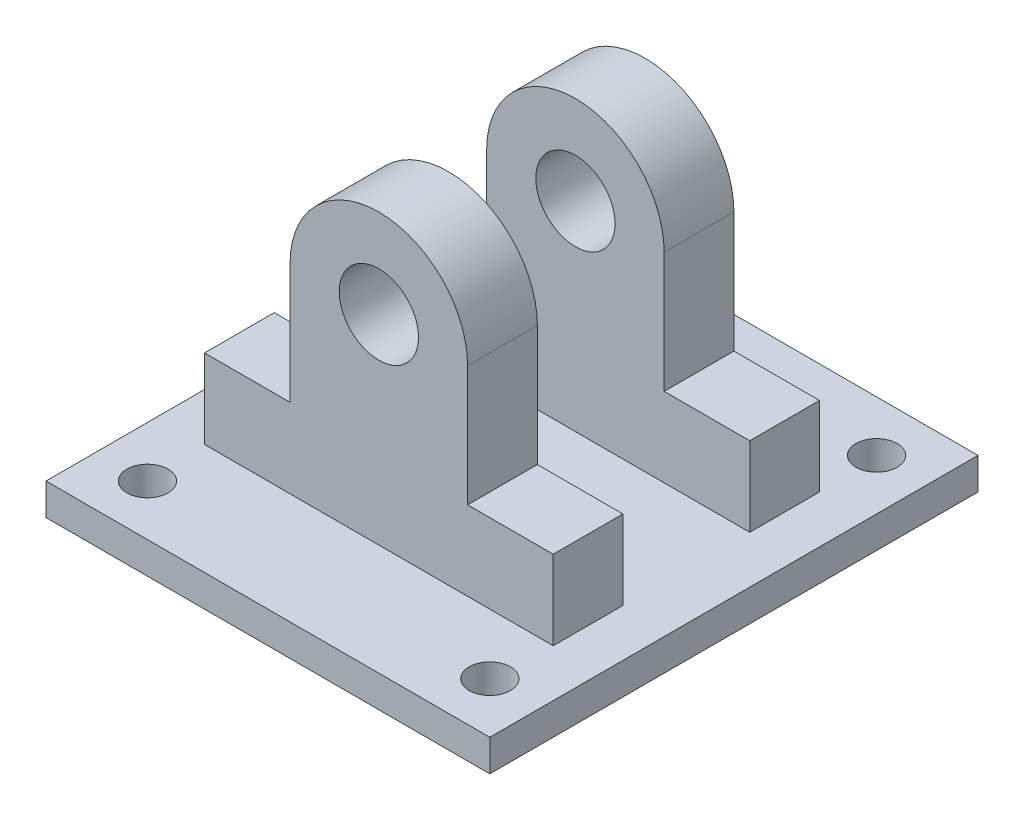
ISO-10303-21;
HEADER;
FILE_DESCRIPTION(('STEP AP214'),'2;1');
FILE_NAME('part.step','',(''),(''),'','','');
FILE_SCHEMA(('AUTOMOTIVE_DESIGN { 1 0 10303 214 1 1 1 1 }'));
ENDSEC;
DATA;
#1=APPLICATION_CONTEXT('core data for automotive mechanical design processes');
#2=APPLICATION_PROTOCOL_DEFINITION('international standard','automotive_design',2000,#1);
#3=PRODUCT_CONTEXT('',#1,'mechanical');
#4=PRODUCT('Part','Part','',(#3));
#5=PRODUCT_RELATED_PRODUCT_CATEGORY('part','',(#4));
#6=PRODUCT_DEFINITION_FORMATION('','',#4);
#7=PRODUCT_DEFINITION_CONTEXT('part definition',#1,'design');
#8=PRODUCT_DEFINITION('design','',#6,#7);
#9=PRODUCT_DEFINITION_SHAPE('','',#8);
#10=(LENGTH_UNIT() NAMED_UNIT(*) SI_UNIT(.MILLI.,.METRE.));
#11=(NAMED_UNIT(*) PLANE_ANGLE_UNIT() SI_UNIT($,.RADIAN.));
#12=(NAMED_UNIT(*) SI_UNIT($,.STERADIAN.) SOLID_ANGLE_UNIT());
#13=UNCERTAINTY_MEASURE_WITH_UNIT(LENGTH_MEASURE(1.E-05),#10,'distance_accuracy_value','');
#14=(GEOMETRIC_REPRESENTATION_CONTEXT(3) GLOBAL_UNCERTAINTY_ASSIGNED_CONTEXT((#13)) GLOBAL_UNIT_ASSIGNED_CONTEXT((#10,
#11,#12)) REPRESENTATION_CONTEXT('',''));
#15=CARTESIAN_POINT('',(0.,0.,0.));
#16=DIRECTION('',(0.,0.,1.));
#17=DIRECTION('',(1.,0.,0.));
#18=AXIS2_PLACEMENT_3D('',#15,#16,#17);
#19=CARTESIAN_POINT('',(-70.,160.,77.));
#20=DIRECTION('',(0.,-1.,0.));
#21=DIRECTION('',(1.,0.,0.));
#22=AXIS2_PLACEMENT_3D('',#19,#20,#21);
#23=PLANE('',#22);
#24=DIRECTION('',(0.,0.,-1.));
#25=VECTOR('',#24,1.);
#26=CARTESIAN_POINT('',(54.9999999999999,159.999999999999,42.));
#27=LINE('',#26,#25);
#28=CARTESIAN_POINT('',(55.,160.,42.));
#29=VERTEX_POINT('',#28);
#30=CARTESIAN_POINT('',(55.,160.,20.));
#31=VERTEX_POINT('',#30);
#32=EDGE_CURVE('E60',#29,#31,#27,.T.);
#33=ORIENTED_EDGE('',*,*,#32,.F.);
#34=DIRECTION('',(1.,0.,0.));
#35=VECTOR('',#34,1.);
#36=CARTESIAN_POINT('',(-55.0000000000001,160.,42.));
#37=LINE('',#36,#35);
#38=CARTESIAN_POINT('',(-55.0000000000001,160.,42.));
#39=VERTEX_POINT('',#38);
#40=EDGE_CURVE('E210',#39,#29,#37,.T.);
#41=ORIENTED_EDGE('',*,*,#40,.F.);
#42=DIRECTION('',(0.,0.,-1.));
#43=VECTOR('',#42,1.);
#44=CARTESIAN_POINT('',(-55.0000000000001,160.,42.));
#45=LINE('',#44,#43);
#46=CARTESIAN_POINT('',(-55.0000000000001,160.,20.));
#47=VERTEX_POINT('',#46);
#48=EDGE_CURVE('E229',#39,#47,#45,.T.);
#49=ORIENTED_EDGE('',*,*,#48,.T.);
#50=DIRECTION('',(1.,0.,0.));
#51=VECTOR('',#50,1.);
#52=CARTESIAN_POINT('',(-55.0000000000001,160.,20.));
#53=LINE('',#52,#51);
#54=EDGE_CURVE('E208',#47,#31,#53,.T.);
#55=ORIENTED_EDGE('',*,*,#54,.T.);
#56=EDGE_LOOP('',(#33,#41,#49,#55));
#57=FACE_BOUND('',#56,.T.);
#58=CARTESIAN_POINT('',(-54.,160.,-61.));
#59=DIRECTION('',(0.,1.,0.));
#60=DIRECTION('',(0.,0.,1.));
#61=AXIS2_PLACEMENT_3D('',#58,#59,#60);
#62=CIRCLE('',#61,6.50000000000001);
#63=CARTESIAN_POINT('',(-54.,160.,-54.5));
#64=VERTEX_POINT('',#63);
#65=EDGE_CURVE('E270',#64,#64,#62,.T.);
#66=ORIENTED_EDGE('',*,*,#65,.F.);
#67=EDGE_LOOP('',(#66));
#68=FACE_BOUND('',#67,.T.);
#69=CARTESIAN_POINT('',(54.,160.,61.));
#70=DIRECTION('',(0.,1.,0.));
#71=DIRECTION('',(0.,0.,-1.));
#72=AXIS2_PLACEMENT_3D('',#69,#70,#71);
#73=CIRCLE('',#72,6.50000000000001);
#74=CARTESIAN_POINT('',(54.,160.,54.5));
#75=VERTEX_POINT('',#74);
#76=EDGE_CURVE('E265',#75,#75,#73,.T.);
#77=ORIENTED_EDGE('',*,*,#76,.F.);
#78=EDGE_LOOP('',(#77));
#79=FACE_BOUND('',#78,.T.);
#80=DIRECTION('',(-1.,0.,0.));
#81=VECTOR('',#80,1.);
#82=CARTESIAN_POINT('',(-70.,160.,-77.));
#83=LINE('',#82,#81);
#84=CARTESIAN_POINT('',(70.,160.,-77.));
#85=VERTEX_POINT('',#84);
#86=CARTESIAN_POINT('',(-70.,160.,-77.));
#87=VERTEX_POINT('',#86);
#88=EDGE_CURVE('E294',#85,#87,#83,.T.);
#89=ORIENTED_EDGE('',*,*,#88,.T.);
#90=DIRECTION('',(0.,0.,-1.));
#91=VECTOR('',#90,1.);
#92=CARTESIAN_POINT('',(-70.,160.,77.));
#93=LINE('',#92,#91);
#94=CARTESIAN_POINT('',(-70.,160.,77.));
#95=VERTEX_POINT('',#94);
#96=EDGE_CURVE('E300',#95,#87,#93,.T.);
#97=ORIENTED_EDGE('',*,*,#96,.F.);
#98=DIRECTION('',(-1.,0.,0.));
#99=VECTOR('',#98,1.);
#100=CARTESIAN_POINT('',(-70.,160.,77.));
#101=LINE('',#100,#99);
#102=CARTESIAN_POINT('',(70.,160.,77.));
#103=VERTEX_POINT('',#102);
#104=EDGE_CURVE('E298',#103,#95,#101,.T.);
#105=ORIENTED_EDGE('',*,*,#104,.F.);
#106=DIRECTION('',(0.,0.,-1.));
#107=VECTOR('',#106,1.);
#108=CARTESIAN_POINT('',(70.,160.,77.));
#109=LINE('',#108,#107);
#110=EDGE_CURVE('E310',#103,#85,#109,.T.);
#111=ORIENTED_EDGE('',*,*,#110,.T.);
#112=EDGE_LOOP('',(#89,#97,#105,#111));
#113=FACE_BOUND('',#112,.T.);
#114=CARTESIAN_POINT('',(-54.,160.,61.));
#115=DIRECTION('',(0.,1.,0.));
#116=DIRECTION('',(0.,0.,-1.));
#117=AXIS2_PLACEMENT_3D('',#114,#115,#116);
#118=CIRCLE('',#117,6.50000000000001);
#119=CARTESIAN_POINT('',(-54.,160.,54.5));
#120=VERTEX_POINT('',#119);
#121=EDGE_CURVE('E273',#120,#120,#118,.T.);
#122=ORIENTED_EDGE('',*,*,#121,.F.);
#123=EDGE_LOOP('',(#122));
#124=FACE_BOUND('',#123,.T.);
#125=CARTESIAN_POINT('',(54.,160.,-61.));
#126=DIRECTION('',(0.,1.,0.));
#127=DIRECTION('',(0.,0.,1.));
#128=AXIS2_PLACEMENT_3D('',#125,#126,#127);
#129=CIRCLE('',#128,6.50000000000001);
#130=CARTESIAN_POINT('',(54.,160.,-54.5));
#131=VERTEX_POINT('',#130);
#132=EDGE_CURVE('E266',#131,#131,#129,.T.);
#133=ORIENTED_EDGE('',*,*,#132,.F.);
#134=EDGE_LOOP('',(#133));
#135=FACE_BOUND('',#134,.T.);
#136=DIRECTION('',(1.,0.,0.));
#137=VECTOR('',#136,1.);
#138=CARTESIAN_POINT('',(-55.0000000000001,160.,-42.));
#139=LINE('',#138,#137);
#140=CARTESIAN_POINT('',(-55.0000000000001,160.,-42.));
#141=VERTEX_POINT('',#140);
#142=CARTESIAN_POINT('',(54.9999999999999,159.999999999999,-42.));
#143=VERTEX_POINT('',#142);
#144=EDGE_CURVE('E176',#141,#143,#139,.T.);
#145=ORIENTED_EDGE('',*,*,#144,.T.);
#146=DIRECTION('',(0.,0.,1.));
#147=VECTOR('',#146,1.);
#148=CARTESIAN_POINT('',(54.9999999999999,159.999999999999,-42.));
#149=LINE('',#148,#147);
#150=CARTESIAN_POINT('',(54.9999999999999,159.999999999999,-20.));
#151=VERTEX_POINT('',#150);
#152=EDGE_CURVE('E666',#143,#151,#149,.T.);
#153=ORIENTED_EDGE('',*,*,#152,.T.);
#154=DIRECTION('',(1.,0.,0.));
#155=VECTOR('',#154,1.);
#156=CARTESIAN_POINT('',(-55.0000000000001,160.,-20.));
#157=LINE('',#156,#155);
#158=CARTESIAN_POINT('',(-55.0000000000001,160.,-20.));
#159=VERTEX_POINT('',#158);
#160=EDGE_CURVE('E197',#159,#151,#157,.T.);
#161=ORIENTED_EDGE('',*,*,#160,.F.);
#162=DIRECTION('',(0.,0.,1.));
#163=VECTOR('',#162,1.);
#164=CARTESIAN_POINT('',(-55.0000000000001,160.,-42.));
#165=LINE('',#164,#163);
#166=EDGE_CURVE('E192',#141,#159,#165,.T.);
#167=ORIENTED_EDGE('',*,*,#166,.F.);
#168=EDGE_LOOP('',(#145,#153,#161,#167));
#169=FACE_BOUND('',#168,.T.);
#170=ADVANCED_FACE('F37',(#57,#68,#79,#113,#124,#135,#169),#23,.F.);
#171=CARTESIAN_POINT('',(-70.,150.,77.));
#172=DIRECTION('',(0.,1.,0.));
#173=DIRECTION('',(-1.,0.,0.));
#174=AXIS2_PLACEMENT_3D('',#171,#172,#173);
#175=PLANE('',#174);
#176=CARTESIAN_POINT('',(-54.,150.,-61.));
#177=DIRECTION('',(0.,1.,0.));
#178=DIRECTION('',(-1.,0.,0.));
#179=AXIS2_PLACEMENT_3D('',#176,#177,#178);
#180=CIRCLE('',#179,6.50000000000001);
#181=CARTESIAN_POINT('',(-60.5,150.,-61.));
#182=VERTEX_POINT('',#181);
#183=EDGE_CURVE('E283',#182,#182,#180,.F.);
#184=ORIENTED_EDGE('',*,*,#183,.F.);
#185=EDGE_LOOP('',(#184));
#186=FACE_BOUND('',#185,.T.);
#187=CARTESIAN_POINT('',(54.,150.,61.));
#188=DIRECTION('',(0.,1.,0.));
#189=DIRECTION('',(-1.,0.,0.));
#190=AXIS2_PLACEMENT_3D('',#187,#188,#189);
#191=CIRCLE('',#190,6.50000000000001);
#192=CARTESIAN_POINT('',(47.5,150.,61.));
#193=VERTEX_POINT('',#192);
#194=EDGE_CURVE('E269',#193,#193,#191,.F.);
#195=ORIENTED_EDGE('',*,*,#194,.F.);
#196=EDGE_LOOP('',(#195));
#197=FACE_BOUND('',#196,.T.);
#198=DIRECTION('',(1.,0.,0.));
#199=VECTOR('',#198,1.);
#200=CARTESIAN_POINT('',(-70.,150.,-77.));
#201=LINE('',#200,#199);
#202=CARTESIAN_POINT('',(-70.,150.,-77.));
#203=VERTEX_POINT('',#202);
#204=CARTESIAN_POINT('',(70.,150.,-77.));
#205=VERTEX_POINT('',#204);
#206=EDGE_CURVE('E303',#203,#205,#201,.T.);
#207=ORIENTED_EDGE('',*,*,#206,.T.);
#208=DIRECTION('',(0.,0.,-1.));
#209=VECTOR('',#208,1.);
#210=CARTESIAN_POINT('',(70.,150.,77.));
#211=LINE('',#210,#209);
#212=CARTESIAN_POINT('',(70.,150.,77.));
#213=VERTEX_POINT('',#212);
#214=EDGE_CURVE('E45',#213,#205,#211,.T.);
#215=ORIENTED_EDGE('',*,*,#214,.F.);
#216=DIRECTION('',(1.,0.,0.));
#217=VECTOR('',#216,1.);
#218=CARTESIAN_POINT('',(-70.,150.,77.));
#219=LINE('',#218,#217);
#220=CARTESIAN_POINT('',(-70.,150.,77.));
#221=VERTEX_POINT('',#220);
#222=EDGE_CURVE('E293',#221,#213,#219,.T.);
#223=ORIENTED_EDGE('',*,*,#222,.F.);
#224=DIRECTION('',(0.,0.,-1.));
#225=VECTOR('',#224,1.);
#226=CARTESIAN_POINT('',(-70.,150.,77.));
#227=LINE('',#226,#225);
#228=EDGE_CURVE('E11',#221,#203,#227,.T.);
#229=ORIENTED_EDGE('',*,*,#228,.T.);
#230=EDGE_LOOP('',(#207,#215,#223,#229));
#231=FACE_BOUND('',#230,.T.);
#232=CARTESIAN_POINT('',(-54.,150.,61.));
#233=DIRECTION('',(0.,1.,0.));
#234=DIRECTION('',(-1.,0.,0.));
#235=AXIS2_PLACEMENT_3D('',#232,#233,#234);
#236=CIRCLE('',#235,6.50000000000001);
#237=CARTESIAN_POINT('',(-60.5,150.,61.));
#238=VERTEX_POINT('',#237);
#239=EDGE_CURVE('E280',#238,#238,#236,.F.);
#240=ORIENTED_EDGE('',*,*,#239,.F.);
#241=EDGE_LOOP('',(#240));
#242=FACE_BOUND('',#241,.T.);
#243=CARTESIAN_POINT('',(54.,150.,-61.));
#244=DIRECTION('',(0.,1.,0.));
#245=DIRECTION('',(-1.,0.,0.));
#246=AXIS2_PLACEMENT_3D('',#243,#244,#245);
#247=CIRCLE('',#246,6.50000000000001);
#248=CARTESIAN_POINT('',(47.5,150.,-61.));
#249=VERTEX_POINT('',#248);
#250=EDGE_CURVE('E286',#249,#249,#247,.F.);
#251=ORIENTED_EDGE('',*,*,#250,.F.);
#252=EDGE_LOOP('',(#251));
#253=FACE_BOUND('',#252,.T.);
#254=ADVANCED_FACE('F333',(#186,#197,#231,#242,#253),#175,.F.);
#255=CARTESIAN_POINT('',(-70.,150.,77.));
#256=DIRECTION('',(1.,0.,0.));
#257=DIRECTION('',(0.,1.,0.));
#258=AXIS2_PLACEMENT_3D('',#255,#256,#257);
#259=PLANE('',#258);
#260=DIRECTION('',(0.,-1.,0.));
#261=VECTOR('',#260,1.);
#262=CARTESIAN_POINT('',(-70.,150.,-77.));
#263=LINE('',#262,#261);
#264=EDGE_CURVE('E289',#87,#203,#263,.T.);
#265=ORIENTED_EDGE('',*,*,#264,.T.);
#266=ORIENTED_EDGE('',*,*,#228,.F.);
#267=DIRECTION('',(0.,-1.,0.));
#268=VECTOR('',#267,1.);
#269=CARTESIAN_POINT('',(-70.,150.,77.));
#270=LINE('',#269,#268);
#271=EDGE_CURVE('E290',#95,#221,#270,.T.);
#272=ORIENTED_EDGE('',*,*,#271,.F.);
#273=ORIENTED_EDGE('',*,*,#96,.T.);
#274=EDGE_LOOP('',(#265,#266,#272,#273));
#275=FACE_BOUND('',#274,.T.);
#276=ADVANCED_FACE('F39',(#275),#259,.F.);
#277=CARTESIAN_POINT('',(70.,150.,77.));
#278=DIRECTION('',(-1.,0.,0.));
#279=DIRECTION('',(0.,0.,1.));
#280=AXIS2_PLACEMENT_3D('',#277,#278,#279);
#281=PLANE('',#280);
#282=DIRECTION('',(0.,1.,0.));
#283=VECTOR('',#282,1.);
#284=CARTESIAN_POINT('',(70.,150.,-77.));
#285=LINE('',#284,#283);
#286=EDGE_CURVE('E305',#205,#85,#285,.T.);
#287=ORIENTED_EDGE('',*,*,#286,.T.);
#288=ORIENTED_EDGE('',*,*,#110,.F.);
#289=DIRECTION('',(0.,1.,0.));
#290=VECTOR('',#289,1.);
#291=CARTESIAN_POINT('',(70.,150.,77.));
#292=LINE('',#291,#290);
#293=EDGE_CURVE('E296',#213,#103,#292,.T.);
#294=ORIENTED_EDGE('',*,*,#293,.F.);
#295=ORIENTED_EDGE('',*,*,#214,.T.);
#296=EDGE_LOOP('',(#287,#288,#294,#295));
#297=FACE_BOUND('',#296,.T.);
#298=ADVANCED_FACE('F317',(#297),#281,.F.);
#299=CARTESIAN_POINT('',(0.,0.,77.));
#300=DIRECTION('',(0.,0.,-1.));
#301=DIRECTION('',(-1.,0.,0.));
#302=AXIS2_PLACEMENT_3D('',#299,#300,#301);
#303=PLANE('',#302);
#304=ORIENTED_EDGE('',*,*,#271,.T.);
#305=ORIENTED_EDGE('',*,*,#222,.T.);
#306=ORIENTED_EDGE('',*,*,#293,.T.);
#307=ORIENTED_EDGE('',*,*,#104,.T.);
#308=EDGE_LOOP('',(#304,#305,#306,#307));
#309=FACE_BOUND('',#308,.T.);
#310=ADVANCED_FACE('F332',(#309),#303,.F.);
#311=CARTESIAN_POINT('',(0.,0.,-77.));
#312=DIRECTION('',(0.,0.,-1.));
#313=DIRECTION('',(-1.,0.,0.));
#314=AXIS2_PLACEMENT_3D('',#311,#312,#313);
#315=PLANE('',#314);
#316=ORIENTED_EDGE('',*,*,#264,.F.);
#317=ORIENTED_EDGE('',*,*,#88,.F.);
#318=ORIENTED_EDGE('',*,*,#286,.F.);
#319=ORIENTED_EDGE('',*,*,#206,.F.);
#320=EDGE_LOOP('',(#316,#317,#318,#319));
#321=FACE_BOUND('',#320,.T.);
#322=ADVANCED_FACE('F323',(#321),#315,.T.);
#323=CARTESIAN_POINT('',(54.,160.,61.));
#324=DIRECTION('',(0.,-1.,0.));
#325=DIRECTION('',(0.,0.,-1.));
#326=AXIS2_PLACEMENT_3D('',#323,#324,#325);
#327=CYLINDRICAL_SURFACE('',#326,6.50000000000001);
#328=ORIENTED_EDGE('',*,*,#76,.T.);
#329=EDGE_LOOP('',(#328));
#330=FACE_BOUND('',#329,.T.);
#331=ORIENTED_EDGE('',*,*,#194,.T.);
#332=EDGE_LOOP('',(#331));
#333=FACE_BOUND('',#332,.T.);
#334=ADVANCED_FACE('F388',(#330,#333),#327,.F.);
#335=CARTESIAN_POINT('',(-54.,160.,61.));
#336=DIRECTION('',(0.,-1.,0.));
#337=DIRECTION('',(0.,0.,-1.));
#338=AXIS2_PLACEMENT_3D('',#335,#336,#337);
#339=CYLINDRICAL_SURFACE('',#338,6.50000000000001);
#340=ORIENTED_EDGE('',*,*,#121,.T.);
#341=EDGE_LOOP('',(#340));
#342=FACE_BOUND('',#341,.T.);
#343=ORIENTED_EDGE('',*,*,#239,.T.);
#344=EDGE_LOOP('',(#343));
#345=FACE_BOUND('',#344,.T.);
#346=ADVANCED_FACE('F354',(#342,#345),#339,.F.);
#347=CARTESIAN_POINT('',(-54.,160.,-61.));
#348=DIRECTION('',(0.,-1.,0.));
#349=DIRECTION('',(0.,0.,-1.));
#350=AXIS2_PLACEMENT_3D('',#347,#348,#349);
#351=CYLINDRICAL_SURFACE('',#350,6.50000000000001);
#352=ORIENTED_EDGE('',*,*,#65,.T.);
#353=EDGE_LOOP('',(#352));
#354=FACE_BOUND('',#353,.T.);
#355=ORIENTED_EDGE('',*,*,#183,.T.);
#356=EDGE_LOOP('',(#355));
#357=FACE_BOUND('',#356,.T.);
#358=ADVANCED_FACE('F344',(#354,#357),#351,.F.);
#359=CARTESIAN_POINT('',(54.,160.,-61.));
#360=DIRECTION('',(0.,-1.,0.));
#361=DIRECTION('',(0.,0.,-1.));
#362=AXIS2_PLACEMENT_3D('',#359,#360,#361);
#363=CYLINDRICAL_SURFACE('',#362,6.50000000000001);
#364=ORIENTED_EDGE('',*,*,#132,.T.);
#365=EDGE_LOOP('',(#364));
#366=FACE_BOUND('',#365,.T.);
#367=ORIENTED_EDGE('',*,*,#250,.T.);
#368=EDGE_LOOP('',(#367));
#369=FACE_BOUND('',#368,.T.);
#370=ADVANCED_FACE('F341',(#366,#369),#363,.F.);
#371=CARTESIAN_POINT('',(1.6306400674182E-13,223.,42.));
#372=DIRECTION('',(0.,0.,-1.));
#373=DIRECTION('',(-1.,0.,0.));
#374=AXIS2_PLACEMENT_3D('',#371,#372,#373);
#375=PLANE('',#374);
#376=ORIENTED_EDGE('',*,*,#40,.T.);
#377=DIRECTION('',(0.,1.,0.));
#378=VECTOR('',#377,1.);
#379=CARTESIAN_POINT('',(54.9999999999999,159.999999999999,42.));
#380=LINE('',#379,#378);
#381=CARTESIAN_POINT('',(55.,184.999999999999,42.));
#382=VERTEX_POINT('',#381);
#383=EDGE_CURVE('E213',#29,#382,#380,.T.);
#384=ORIENTED_EDGE('',*,*,#383,.T.);
#385=DIRECTION('',(-1.,0.,0.));
#386=VECTOR('',#385,1.);
#387=CARTESIAN_POINT('',(28.,185.,42.));
#388=LINE('',#387,#386);
#389=CARTESIAN_POINT('',(28.,185.,42.));
#390=VERTEX_POINT('',#389);
#391=EDGE_CURVE('E216',#382,#390,#388,.T.);
#392=ORIENTED_EDGE('',*,*,#391,.T.);
#393=DIRECTION('',(0.,1.,0.));
#394=VECTOR('',#393,1.);
#395=CARTESIAN_POINT('',(28.,185.,42.));
#396=LINE('',#395,#394);
#397=CARTESIAN_POINT('',(28.0000000000002,223.,42.));
#398=VERTEX_POINT('',#397);
#399=EDGE_CURVE('E218',#390,#398,#396,.T.);
#400=ORIENTED_EDGE('',*,*,#399,.T.);
#401=CARTESIAN_POINT('',(1.6306400674182E-13,223.,42.));
#402=DIRECTION('',(0.,0.,1.));
#403=DIRECTION('',(-1.,0.,0.));
#404=AXIS2_PLACEMENT_3D('',#401,#402,#403);
#405=CIRCLE('',#404,28.);
#406=CARTESIAN_POINT('',(-27.9999999999998,223.,42.));
#407=VERTEX_POINT('',#406);
#408=EDGE_CURVE('E220',#398,#407,#405,.T.);
#409=ORIENTED_EDGE('',*,*,#408,.T.);
#410=DIRECTION('',(0.,-1.,0.));
#411=VECTOR('',#410,1.);
#412=CARTESIAN_POINT('',(-28.,185.,42.));
#413=LINE('',#412,#411);
#414=CARTESIAN_POINT('',(-28.,185.,42.));
#415=VERTEX_POINT('',#414);
#416=EDGE_CURVE('E222',#407,#415,#413,.T.);
#417=ORIENTED_EDGE('',*,*,#416,.T.);
#418=DIRECTION('',(-1.,0.,0.));
#419=VECTOR('',#418,1.);
#420=CARTESIAN_POINT('',(-55.,185.,42.));
#421=LINE('',#420,#419);
#422=CARTESIAN_POINT('',(-55.,185.,42.));
#423=VERTEX_POINT('',#422);
#424=EDGE_CURVE('E224',#415,#423,#421,.T.);
#425=ORIENTED_EDGE('',*,*,#424,.T.);
#426=DIRECTION('',(0.,-1.,0.));
#427=VECTOR('',#426,1.);
#428=CARTESIAN_POINT('',(-55.0000000000001,160.,42.));
#429=LINE('',#428,#427);
#430=EDGE_CURVE('E226',#423,#39,#429,.T.);
#431=ORIENTED_EDGE('',*,*,#430,.T.);
#432=EDGE_LOOP('',(#376,#384,#392,#400,#409,#417,#425,#431));
#433=FACE_BOUND('',#432,.T.);
#434=CARTESIAN_POINT('',(1.6306400674182E-13,223.,42.));
#435=DIRECTION('',(0.,0.,1.));
#436=DIRECTION('',(1.,0.,0.));
#437=AXIS2_PLACEMENT_3D('',#434,#435,#436);
#438=CIRCLE('',#437,12.5);
#439=CARTESIAN_POINT('',(12.5000000000002,223.,42.));
#440=VERTEX_POINT('',#439);
#441=EDGE_CURVE('E201',#440,#440,#438,.T.);
#442=ORIENTED_EDGE('',*,*,#441,.F.);
#443=EDGE_LOOP('',(#442));
#444=FACE_BOUND('',#443,.T.);
#445=ADVANCED_FACE('F343',(#433,#444),#375,.F.);
#446=CARTESIAN_POINT('',(1.6306400674182E-13,223.,20.));
#447=DIRECTION('',(0.,0.,-1.));
#448=DIRECTION('',(-1.,0.,0.));
#449=AXIS2_PLACEMENT_3D('',#446,#447,#448);
#450=PLANE('',#449);
#451=ORIENTED_EDGE('',*,*,#54,.F.);
#452=DIRECTION('',(0.,-1.,0.));
#453=VECTOR('',#452,1.);
#454=CARTESIAN_POINT('',(-55.0000000000001,160.,20.));
#455=LINE('',#454,#453);
#456=CARTESIAN_POINT('',(-55.,185.,20.));
#457=VERTEX_POINT('',#456);
#458=EDGE_CURVE('E214',#457,#47,#455,.T.);
#459=ORIENTED_EDGE('',*,*,#458,.F.);
#460=DIRECTION('',(-1.,0.,0.));
#461=VECTOR('',#460,1.);
#462=CARTESIAN_POINT('',(-55.,185.,20.));
#463=LINE('',#462,#461);
#464=CARTESIAN_POINT('',(-28.,185.,20.));
#465=VERTEX_POINT('',#464);
#466=EDGE_CURVE('E241',#465,#457,#463,.T.);
#467=ORIENTED_EDGE('',*,*,#466,.F.);
#468=DIRECTION('',(0.,-1.,0.));
#469=VECTOR('',#468,1.);
#470=CARTESIAN_POINT('',(-28.,185.,20.));
#471=LINE('',#470,#469);
#472=CARTESIAN_POINT('',(-27.9999999999998,223.,20.));
#473=VERTEX_POINT('',#472);
#474=EDGE_CURVE('E239',#473,#465,#471,.T.);
#475=ORIENTED_EDGE('',*,*,#474,.F.);
#476=CARTESIAN_POINT('',(1.6306400674182E-13,223.,20.));
#477=DIRECTION('',(0.,0.,1.));
#478=DIRECTION('',(-1.,0.,0.));
#479=AXIS2_PLACEMENT_3D('',#476,#477,#478);
#480=CIRCLE('',#479,28.);
#481=CARTESIAN_POINT('',(28.0000000000002,223.,20.));
#482=VERTEX_POINT('',#481);
#483=EDGE_CURVE('E237',#482,#473,#480,.T.);
#484=ORIENTED_EDGE('',*,*,#483,.F.);
#485=DIRECTION('',(0.,1.,0.));
#486=VECTOR('',#485,1.);
#487=CARTESIAN_POINT('',(28.,185.,20.));
#488=LINE('',#487,#486);
#489=CARTESIAN_POINT('',(28.,185.,20.));
#490=VERTEX_POINT('',#489);
#491=EDGE_CURVE('E235',#490,#482,#488,.T.);
#492=ORIENTED_EDGE('',*,*,#491,.F.);
#493=DIRECTION('',(-1.,0.,0.));
#494=VECTOR('',#493,1.);
#495=CARTESIAN_POINT('',(28.,185.,20.));
#496=LINE('',#495,#494);
#497=CARTESIAN_POINT('',(55.,184.999999999999,20.));
#498=VERTEX_POINT('',#497);
#499=EDGE_CURVE('E233',#498,#490,#496,.T.);
#500=ORIENTED_EDGE('',*,*,#499,.F.);
#501=DIRECTION('',(0.,1.,0.));
#502=VECTOR('',#501,1.);
#503=CARTESIAN_POINT('',(54.9999999999999,159.999999999999,20.));
#504=LINE('',#503,#502);
#505=EDGE_CURVE('E231',#31,#498,#504,.T.);
#506=ORIENTED_EDGE('',*,*,#505,.F.);
#507=EDGE_LOOP('',(#451,#459,#467,#475,#484,#492,#500,#506));
#508=FACE_BOUND('',#507,.T.);
#509=CARTESIAN_POINT('',(1.6306400674182E-13,223.,20.));
#510=DIRECTION('',(0.,0.,1.));
#511=DIRECTION('',(1.,0.,0.));
#512=AXIS2_PLACEMENT_3D('',#509,#510,#511);
#513=CIRCLE('',#512,12.5);
#514=CARTESIAN_POINT('',(12.5000000000002,223.,20.));
#515=VERTEX_POINT('',#514);
#516=EDGE_CURVE('E198',#515,#515,#513,.T.);
#517=ORIENTED_EDGE('',*,*,#516,.T.);
#518=EDGE_LOOP('',(#517));
#519=FACE_BOUND('',#518,.T.);
#520=ADVANCED_FACE('F351',(#508,#519),#450,.T.);
#521=CARTESIAN_POINT('',(54.9999999999999,159.999999999999,42.));
#522=DIRECTION('',(-1.,0.,0.));
#523=DIRECTION('',(0.,-1.,0.));
#524=AXIS2_PLACEMENT_3D('',#521,#522,#523);
#525=PLANE('',#524);
#526=ORIENTED_EDGE('',*,*,#505,.T.);
#527=DIRECTION('',(0.,0.,-1.));
#528=VECTOR('',#527,1.);
#529=CARTESIAN_POINT('',(55.,184.999999999999,42.));
#530=LINE('',#529,#528);
#531=EDGE_CURVE('E261',#382,#498,#530,.T.);
#532=ORIENTED_EDGE('',*,*,#531,.F.);
#533=ORIENTED_EDGE('',*,*,#383,.F.);
#534=ORIENTED_EDGE('',*,*,#32,.T.);
#535=EDGE_LOOP('',(#526,#532,#533,#534));
#536=FACE_BOUND('',#535,.T.);
#537=ADVANCED_FACE('F426',(#536),#525,.F.);
#538=CARTESIAN_POINT('',(28.,185.,42.));
#539=DIRECTION('',(0.,-1.,0.));
#540=DIRECTION('',(1.,0.,0.));
#541=AXIS2_PLACEMENT_3D('',#538,#539,#540);
#542=PLANE('',#541);
#543=ORIENTED_EDGE('',*,*,#499,.T.);
#544=DIRECTION('',(0.,0.,-1.));
#545=VECTOR('',#544,1.);
#546=CARTESIAN_POINT('',(28.,185.,42.));
#547=LINE('',#546,#545);
#548=EDGE_CURVE('E258',#390,#490,#547,.T.);
#549=ORIENTED_EDGE('',*,*,#548,.F.);
#550=ORIENTED_EDGE('',*,*,#391,.F.);
#551=ORIENTED_EDGE('',*,*,#531,.T.);
#552=EDGE_LOOP('',(#543,#549,#550,#551));
#553=FACE_BOUND('',#552,.T.);
#554=ADVANCED_FACE('F436',(#553),#542,.F.);
#555=CARTESIAN_POINT('',(28.,185.,42.));
#556=DIRECTION('',(-1.,0.,0.));
#557=DIRECTION('',(0.,-1.,0.));
#558=AXIS2_PLACEMENT_3D('',#555,#556,#557);
#559=PLANE('',#558);
#560=ORIENTED_EDGE('',*,*,#491,.T.);
#561=DIRECTION('',(0.,0.,-1.));
#562=VECTOR('',#561,1.);
#563=CARTESIAN_POINT('',(28.0000000000002,223.,42.));
#564=LINE('',#563,#562);
#565=EDGE_CURVE('E255',#398,#482,#564,.T.);
#566=ORIENTED_EDGE('',*,*,#565,.F.);
#567=ORIENTED_EDGE('',*,*,#399,.F.);
#568=ORIENTED_EDGE('',*,*,#548,.T.);
#569=EDGE_LOOP('',(#560,#566,#567,#568));
#570=FACE_BOUND('',#569,.T.);
#571=ADVANCED_FACE('F445',(#570),#559,.F.);
#572=CARTESIAN_POINT('',(1.6306400674182E-13,223.,42.));
#573=DIRECTION('',(0.,0.,-1.));
#574=DIRECTION('',(-1.,0.,0.));
#575=AXIS2_PLACEMENT_3D('',#572,#573,#574);
#576=CYLINDRICAL_SURFACE('',#575,28.);
#577=ORIENTED_EDGE('',*,*,#483,.T.);
#578=DIRECTION('',(0.,0.,-1.));
#579=VECTOR('',#578,1.);
#580=CARTESIAN_POINT('',(-27.9999999999998,223.,42.));
#581=LINE('',#580,#579);
#582=EDGE_CURVE('E252',#407,#473,#581,.T.);
#583=ORIENTED_EDGE('',*,*,#582,.F.);
#584=ORIENTED_EDGE('',*,*,#408,.F.);
#585=ORIENTED_EDGE('',*,*,#565,.T.);
#586=EDGE_LOOP('',(#577,#583,#584,#585));
#587=FACE_BOUND('',#586,.T.);
#588=ADVANCED_FACE('F455',(#587),#576,.T.);
#589=CARTESIAN_POINT('',(-28.,185.,42.));
#590=DIRECTION('',(1.,0.,0.));
#591=DIRECTION('',(0.,1.,0.));
#592=AXIS2_PLACEMENT_3D('',#589,#590,#591);
#593=PLANE('',#592);
#594=ORIENTED_EDGE('',*,*,#474,.T.);
#595=DIRECTION('',(0.,0.,-1.));
#596=VECTOR('',#595,1.);
#597=CARTESIAN_POINT('',(-28.,185.,42.));
#598=LINE('',#597,#596);
#599=EDGE_CURVE('E249',#415,#465,#598,.T.);
#600=ORIENTED_EDGE('',*,*,#599,.F.);
#601=ORIENTED_EDGE('',*,*,#416,.F.);
#602=ORIENTED_EDGE('',*,*,#582,.T.);
#603=EDGE_LOOP('',(#594,#600,#601,#602));
#604=FACE_BOUND('',#603,.T.);
#605=ADVANCED_FACE('F465',(#604),#593,.F.);
#606=CARTESIAN_POINT('',(-55.,185.,42.));
#607=DIRECTION('',(0.,-1.,0.));
#608=DIRECTION('',(1.,0.,0.));
#609=AXIS2_PLACEMENT_3D('',#606,#607,#608);
#610=PLANE('',#609);
#611=ORIENTED_EDGE('',*,*,#466,.T.);
#612=DIRECTION('',(0.,0.,-1.));
#613=VECTOR('',#612,1.);
#614=CARTESIAN_POINT('',(-55.,185.,42.));
#615=LINE('',#614,#613);
#616=EDGE_CURVE('E246',#423,#457,#615,.T.);
#617=ORIENTED_EDGE('',*,*,#616,.F.);
#618=ORIENTED_EDGE('',*,*,#424,.F.);
#619=ORIENTED_EDGE('',*,*,#599,.T.);
#620=EDGE_LOOP('',(#611,#617,#618,#619));
#621=FACE_BOUND('',#620,.T.);
#622=ADVANCED_FACE('F475',(#621),#610,.F.);
#623=CARTESIAN_POINT('',(-55.0000000000001,160.,42.));
#624=DIRECTION('',(1.,0.,0.));
#625=DIRECTION('',(0.,1.,0.));
#626=AXIS2_PLACEMENT_3D('',#623,#624,#625);
#627=PLANE('',#626);
#628=ORIENTED_EDGE('',*,*,#458,.T.);
#629=ORIENTED_EDGE('',*,*,#48,.F.);
#630=ORIENTED_EDGE('',*,*,#430,.F.);
#631=ORIENTED_EDGE('',*,*,#616,.T.);
#632=EDGE_LOOP('',(#628,#629,#630,#631));
#633=FACE_BOUND('',#632,.T.);
#634=ADVANCED_FACE('F485',(#633),#627,.F.);
#635=CARTESIAN_POINT('',(1.6306400674182E-13,223.,42.));
#636=DIRECTION('',(0.,0.,-1.));
#637=DIRECTION('',(-1.,0.,0.));
#638=AXIS2_PLACEMENT_3D('',#635,#636,#637);
#639=CYLINDRICAL_SURFACE('',#638,12.5);
#640=ORIENTED_EDGE('',*,*,#441,.T.);
#641=EDGE_LOOP('',(#640));
#642=FACE_BOUND('',#641,.T.);
#643=ORIENTED_EDGE('',*,*,#516,.F.);
#644=EDGE_LOOP('',(#643));
#645=FACE_BOUND('',#644,.T.);
#646=ADVANCED_FACE('F495',(#642,#645),#639,.F.);
#647=CARTESIAN_POINT('',(-55.0000000000001,160.,-42.));
#648=DIRECTION('',(-1.,0.,0.));
#649=DIRECTION('',(0.,-1.,0.));
#650=AXIS2_PLACEMENT_3D('',#647,#648,#649);
#651=PLANE('',#650);
#652=DIRECTION('',(0.,-1.,0.));
#653=VECTOR('',#652,1.);
#654=CARTESIAN_POINT('',(-55.0000000000001,160.,-20.));
#655=LINE('',#654,#653);
#656=CARTESIAN_POINT('',(-55.,185.,-20.));
#657=VERTEX_POINT('',#656);
#658=EDGE_CURVE('E52',#657,#159,#655,.T.);
#659=ORIENTED_EDGE('',*,*,#658,.F.);
#660=DIRECTION('',(0.,0.,1.));
#661=VECTOR('',#660,1.);
#662=CARTESIAN_POINT('',(-55.,185.,-42.));
#663=LINE('',#662,#661);
#664=CARTESIAN_POINT('',(-55.,185.,-42.));
#665=VERTEX_POINT('',#664);
#666=EDGE_CURVE('E194',#665,#657,#663,.T.);
#667=ORIENTED_EDGE('',*,*,#666,.F.);
#668=DIRECTION('',(0.,-1.,0.));
#669=VECTOR('',#668,1.);
#670=CARTESIAN_POINT('',(-55.0000000000001,160.,-42.));
#671=LINE('',#670,#669);
#672=EDGE_CURVE('E180',#665,#141,#671,.T.);
#673=ORIENTED_EDGE('',*,*,#672,.T.);
#674=ORIENTED_EDGE('',*,*,#166,.T.);
#675=EDGE_LOOP('',(#659,#667,#673,#674));
#676=FACE_BOUND('',#675,.T.);
#677=ADVANCED_FACE('F191',(#676),#651,.T.);
#678=CARTESIAN_POINT('',(-55.,185.,-42.));
#679=DIRECTION('',(0.,1.,0.));
#680=DIRECTION('',(-1.,0.,0.));
#681=AXIS2_PLACEMENT_3D('',#678,#679,#680);
#682=PLANE('',#681);
#683=DIRECTION('',(-1.,0.,0.));
#684=VECTOR('',#683,1.);
#685=CARTESIAN_POINT('',(-55.,185.,-20.));
#686=LINE('',#685,#684);
#687=CARTESIAN_POINT('',(-28.,185.,-20.));
#688=VERTEX_POINT('',#687);
#689=EDGE_CURVE('E669',#688,#657,#686,.T.);
#690=ORIENTED_EDGE('',*,*,#689,.F.);
#691=DIRECTION('',(0.,0.,1.));
#692=VECTOR('',#691,1.);
#693=CARTESIAN_POINT('',(-28.,185.,-42.));
#694=LINE('',#693,#692);
#695=CARTESIAN_POINT('',(-28.,185.,-42.));
#696=VERTEX_POINT('',#695);
#697=EDGE_CURVE('E203',#696,#688,#694,.T.);
#698=ORIENTED_EDGE('',*,*,#697,.F.);
#699=DIRECTION('',(-1.,0.,0.));
#700=VECTOR('',#699,1.);
#701=CARTESIAN_POINT('',(-55.,185.,-42.));
#702=LINE('',#701,#700);
#703=EDGE_CURVE('E195',#696,#665,#702,.T.);
#704=ORIENTED_EDGE('',*,*,#703,.T.);
#705=ORIENTED_EDGE('',*,*,#666,.T.);
#706=EDGE_LOOP('',(#690,#698,#704,#705));
#707=FACE_BOUND('',#706,.T.);
#708=ADVANCED_FACE('F519',(#707),#682,.T.);
#709=CARTESIAN_POINT('',(-28.,185.,-42.));
#710=DIRECTION('',(-1.,0.,0.));
#711=DIRECTION('',(0.,-1.,0.));
#712=AXIS2_PLACEMENT_3D('',#709,#710,#711);
#713=PLANE('',#712);
#714=DIRECTION('',(0.,-1.,0.));
#715=VECTOR('',#714,1.);
#716=CARTESIAN_POINT('',(-28.,185.,-20.));
#717=LINE('',#716,#715);
#718=CARTESIAN_POINT('',(-27.9999999999998,223.,-20.));
#719=VERTEX_POINT('',#718);
#720=EDGE_CURVE('E671',#719,#688,#717,.T.);
#721=ORIENTED_EDGE('',*,*,#720,.F.);
#722=DIRECTION('',(0.,0.,1.));
#723=VECTOR('',#722,1.);
#724=CARTESIAN_POINT('',(-27.9999999999998,223.,-42.));
#725=LINE('',#724,#723);
#726=CARTESIAN_POINT('',(-27.9999999999998,223.,-42.));
#727=VERTEX_POINT('',#726);
#728=EDGE_CURVE('E692',#727,#719,#725,.T.);
#729=ORIENTED_EDGE('',*,*,#728,.F.);
#730=DIRECTION('',(0.,-1.,0.));
#731=VECTOR('',#730,1.);
#732=CARTESIAN_POINT('',(-28.,185.,-42.));
#733=LINE('',#732,#731);
#734=EDGE_CURVE('E653',#727,#696,#733,.T.);
#735=ORIENTED_EDGE('',*,*,#734,.T.);
#736=ORIENTED_EDGE('',*,*,#697,.T.);
#737=EDGE_LOOP('',(#721,#729,#735,#736));
#738=FACE_BOUND('',#737,.T.);
#739=ADVANCED_FACE('F530',(#738),#713,.T.);
#740=CARTESIAN_POINT('',(1.6306400674182E-13,223.,-42.));
#741=DIRECTION('',(0.,0.,1.));
#742=DIRECTION('',(1.,0.,0.));
#743=AXIS2_PLACEMENT_3D('',#740,#741,#742);
#744=CYLINDRICAL_SURFACE('',#743,28.);
#745=CARTESIAN_POINT('',(1.6306400674182E-13,223.,-20.));
#746=DIRECTION('',(0.,0.,1.));
#747=DIRECTION('',(-1.,0.,0.));
#748=AXIS2_PLACEMENT_3D('',#745,#746,#747);
#749=CIRCLE('',#748,28.);
#750=CARTESIAN_POINT('',(28.0000000000002,223.,-20.));
#751=VERTEX_POINT('',#750);
#752=EDGE_CURVE('E674',#751,#719,#749,.T.);
#753=ORIENTED_EDGE('',*,*,#752,.F.);
#754=DIRECTION('',(0.,0.,1.));
#755=VECTOR('',#754,1.);
#756=CARTESIAN_POINT('',(28.0000000000002,223.,-42.));
#757=LINE('',#756,#755);
#758=CARTESIAN_POINT('',(28.0000000000002,223.,-42.));
#759=VERTEX_POINT('',#758);
#760=EDGE_CURVE('E690',#759,#751,#757,.T.);
#761=ORIENTED_EDGE('',*,*,#760,.F.);
#762=CARTESIAN_POINT('',(1.6306400674182E-13,223.,-42.));
#763=DIRECTION('',(0.,0.,1.));
#764=DIRECTION('',(-1.,0.,0.));
#765=AXIS2_PLACEMENT_3D('',#762,#763,#764);
#766=CIRCLE('',#765,28.);
#767=EDGE_CURVE('E656',#759,#727,#766,.T.);
#768=ORIENTED_EDGE('',*,*,#767,.T.);
#769=ORIENTED_EDGE('',*,*,#728,.T.);
#770=EDGE_LOOP('',(#753,#761,#768,#769));
#771=FACE_BOUND('',#770,.T.);
#772=ADVANCED_FACE('F541',(#771),#744,.T.);
#773=CARTESIAN_POINT('',(28.,185.,-42.));
#774=DIRECTION('',(1.,0.,0.));
#775=DIRECTION('',(0.,1.,0.));
#776=AXIS2_PLACEMENT_3D('',#773,#774,#775);
#777=PLANE('',#776);
#778=DIRECTION('',(0.,1.,0.));
#779=VECTOR('',#778,1.);
#780=CARTESIAN_POINT('',(28.,185.,-20.));
#781=LINE('',#780,#779);
#782=CARTESIAN_POINT('',(28.,185.,-20.));
#783=VERTEX_POINT('',#782);
#784=EDGE_CURVE('E677',#783,#751,#781,.T.);
#785=ORIENTED_EDGE('',*,*,#784,.F.);
#786=DIRECTION('',(0.,0.,1.));
#787=VECTOR('',#786,1.);
#788=CARTESIAN_POINT('',(28.,185.,-42.));
#789=LINE('',#788,#787);
#790=CARTESIAN_POINT('',(28.,185.,-42.));
#791=VERTEX_POINT('',#790);
#792=EDGE_CURVE('E688',#791,#783,#789,.T.);
#793=ORIENTED_EDGE('',*,*,#792,.F.);
#794=DIRECTION('',(0.,1.,0.));
#795=VECTOR('',#794,1.);
#796=CARTESIAN_POINT('',(28.,185.,-42.));
#797=LINE('',#796,#795);
#798=EDGE_CURVE('E659',#791,#759,#797,.T.);
#799=ORIENTED_EDGE('',*,*,#798,.T.);
#800=ORIENTED_EDGE('',*,*,#760,.T.);
#801=EDGE_LOOP('',(#785,#793,#799,#800));
#802=FACE_BOUND('',#801,.T.);
#803=ADVANCED_FACE('F552',(#802),#777,.T.);
#804=CARTESIAN_POINT('',(28.,185.,-42.));
#805=DIRECTION('',(0.,1.,0.));
#806=DIRECTION('',(-1.,0.,0.));
#807=AXIS2_PLACEMENT_3D('',#804,#805,#806);
#808=PLANE('',#807);
#809=DIRECTION('',(-1.,0.,0.));
#810=VECTOR('',#809,1.);
#811=CARTESIAN_POINT('',(28.,185.,-20.));
#812=LINE('',#811,#810);
#813=CARTESIAN_POINT('',(55.,184.999999999999,-20.));
#814=VERTEX_POINT('',#813);
#815=EDGE_CURVE('E680',#814,#783,#812,.T.);
#816=ORIENTED_EDGE('',*,*,#815,.F.);
#817=DIRECTION('',(0.,0.,1.));
#818=VECTOR('',#817,1.);
#819=CARTESIAN_POINT('',(55.,184.999999999999,-42.));
#820=LINE('',#819,#818);
#821=CARTESIAN_POINT('',(55.,184.999999999999,-42.));
#822=VERTEX_POINT('',#821);
#823=EDGE_CURVE('E686',#822,#814,#820,.T.);
#824=ORIENTED_EDGE('',*,*,#823,.F.);
#825=DIRECTION('',(-1.,0.,0.));
#826=VECTOR('',#825,1.);
#827=CARTESIAN_POINT('',(28.,185.,-42.));
#828=LINE('',#827,#826);
#829=EDGE_CURVE('E662',#822,#791,#828,.T.);
#830=ORIENTED_EDGE('',*,*,#829,.T.);
#831=ORIENTED_EDGE('',*,*,#792,.T.);
#832=EDGE_LOOP('',(#816,#824,#830,#831));
#833=FACE_BOUND('',#832,.T.);
#834=ADVANCED_FACE('F563',(#833),#808,.T.);
#835=CARTESIAN_POINT('',(54.9999999999999,159.999999999999,-42.));
#836=DIRECTION('',(1.,0.,0.));
#837=DIRECTION('',(0.,1.,0.));
#838=AXIS2_PLACEMENT_3D('',#835,#836,#837);
#839=PLANE('',#838);
#840=DIRECTION('',(0.,1.,0.));
#841=VECTOR('',#840,1.);
#842=CARTESIAN_POINT('',(54.9999999999999,159.999999999999,-20.));
#843=LINE('',#842,#841);
#844=EDGE_CURVE('E188',#151,#814,#843,.T.);
#845=ORIENTED_EDGE('',*,*,#844,.F.);
#846=ORIENTED_EDGE('',*,*,#152,.F.);
#847=DIRECTION('',(0.,1.,0.));
#848=VECTOR('',#847,1.);
#849=CARTESIAN_POINT('',(54.9999999999999,159.999999999999,-42.));
#850=LINE('',#849,#848);
#851=EDGE_CURVE('E184',#143,#822,#850,.T.);
#852=ORIENTED_EDGE('',*,*,#851,.T.);
#853=ORIENTED_EDGE('',*,*,#823,.T.);
#854=EDGE_LOOP('',(#845,#846,#852,#853));
#855=FACE_BOUND('',#854,.T.);
#856=ADVANCED_FACE('F574',(#855),#839,.T.);
#857=CARTESIAN_POINT('',(1.6306400674182E-13,223.,-42.));
#858=DIRECTION('',(0.,0.,1.));
#859=DIRECTION('',(-1.,0.,0.));
#860=AXIS2_PLACEMENT_3D('',#857,#858,#859);
#861=PLANE('',#860);
#862=CARTESIAN_POINT('',(1.6306400674182E-13,223.,-42.));
#863=DIRECTION('',(0.,0.,1.));
#864=DIRECTION('',(1.,0.,0.));
#865=AXIS2_PLACEMENT_3D('',#862,#863,#864);
#866=CIRCLE('',#865,12.5);
#867=CARTESIAN_POINT('',(12.5000000000002,223.,-42.));
#868=VERTEX_POINT('',#867);
#869=EDGE_CURVE('E645',#868,#868,#866,.T.);
#870=ORIENTED_EDGE('',*,*,#869,.T.);
#871=EDGE_LOOP('',(#870));
#872=FACE_BOUND('',#871,.T.);
#873=ORIENTED_EDGE('',*,*,#144,.F.);
#874=ORIENTED_EDGE('',*,*,#672,.F.);
#875=ORIENTED_EDGE('',*,*,#703,.F.);
#876=ORIENTED_EDGE('',*,*,#734,.F.);
#877=ORIENTED_EDGE('',*,*,#767,.F.);
#878=ORIENTED_EDGE('',*,*,#798,.F.);
#879=ORIENTED_EDGE('',*,*,#829,.F.);
#880=ORIENTED_EDGE('',*,*,#851,.F.);
#881=EDGE_LOOP('',(#873,#874,#875,#876,#877,#878,#879,#880));
#882=FACE_BOUND('',#881,.T.);
#883=ADVANCED_FACE('F178',(#872,#882),#861,.F.);
#884=CARTESIAN_POINT('',(1.6306400674182E-13,223.,-20.));
#885=DIRECTION('',(0.,0.,1.));
#886=DIRECTION('',(-1.,0.,0.));
#887=AXIS2_PLACEMENT_3D('',#884,#885,#886);
#888=PLANE('',#887);
#889=CARTESIAN_POINT('',(1.6306400674182E-13,223.,-20.));
#890=DIRECTION('',(0.,0.,1.));
#891=DIRECTION('',(1.,0.,0.));
#892=AXIS2_PLACEMENT_3D('',#889,#890,#891);
#893=CIRCLE('',#892,12.5);
#894=CARTESIAN_POINT('',(12.5000000000002,223.,-20.));
#895=VERTEX_POINT('',#894);
#896=EDGE_CURVE('E648',#895,#895,#893,.T.);
#897=ORIENTED_EDGE('',*,*,#896,.F.);
#898=EDGE_LOOP('',(#897));
#899=FACE_BOUND('',#898,.T.);
#900=ORIENTED_EDGE('',*,*,#160,.T.);
#901=ORIENTED_EDGE('',*,*,#844,.T.);
#902=ORIENTED_EDGE('',*,*,#815,.T.);
#903=ORIENTED_EDGE('',*,*,#784,.T.);
#904=ORIENTED_EDGE('',*,*,#752,.T.);
#905=ORIENTED_EDGE('',*,*,#720,.T.);
#906=ORIENTED_EDGE('',*,*,#689,.T.);
#907=ORIENTED_EDGE('',*,*,#658,.T.);
#908=EDGE_LOOP('',(#900,#901,#902,#903,#904,#905,#906,#907));
#909=FACE_BOUND('',#908,.T.);
#910=ADVANCED_FACE('F596',(#899,#909),#888,.T.);
#911=CARTESIAN_POINT('',(1.6306400674182E-13,223.,-42.));
#912=DIRECTION('',(0.,0.,1.));
#913=DIRECTION('',(1.,0.,0.));
#914=AXIS2_PLACEMENT_3D('',#911,#912,#913);
#915=CYLINDRICAL_SURFACE('',#914,12.5);
#916=ORIENTED_EDGE('',*,*,#869,.F.);
#917=EDGE_LOOP('',(#916));
#918=FACE_BOUND('',#917,.T.);
#919=ORIENTED_EDGE('',*,*,#896,.T.);
#920=EDGE_LOOP('',(#919));
#921=FACE_BOUND('',#920,.T.);
#922=ADVANCED_FACE('F606',(#918,#921),#915,.F.);
#923=CLOSED_SHELL('',(#170,#254,#276,#298,#310,#322,#334,#346,#358,#370,#445,#520,#537,#554,
#571,#588,#605,#622,#634,#646,#677,#708,#739,#772,#803,#834,#856,#883,#910,#922));
#924=MANIFOLD_SOLID_BREP('B2',#923);
#925=ADVANCED_BREP_SHAPE_REPRESENTATION('',(#18,#924),#14);
#926=SHAPE_DEFINITION_REPRESENTATION(#9,#925);
ENDSEC;
END-ISO-10303-21;
